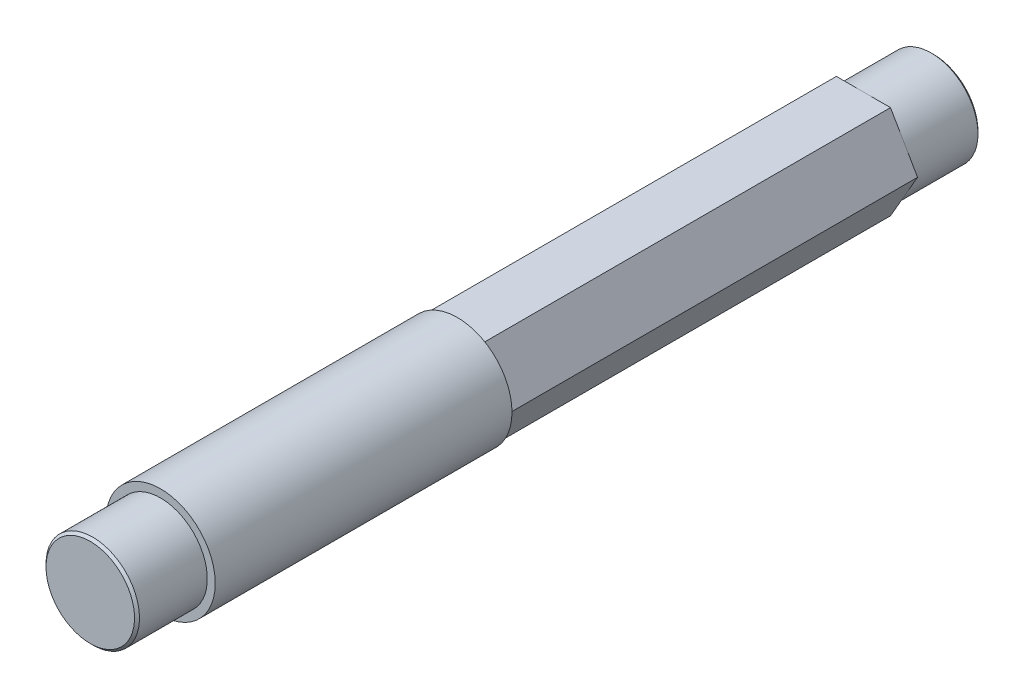
ISO-10303-21;
HEADER;
FILE_DESCRIPTION(('STEP AP214'),'2;1');
FILE_NAME('part.step','',(''),(''),'','','');
FILE_SCHEMA(('AUTOMOTIVE_DESIGN { 1 0 10303 214 1 1 1 1 }'));
ENDSEC;
DATA;
#1=APPLICATION_CONTEXT('core data for automotive mechanical design processes');
#2=APPLICATION_PROTOCOL_DEFINITION('international standard','automotive_design',2000,#1);
#3=PRODUCT_CONTEXT('',#1,'mechanical');
#4=PRODUCT('Part','Part','',(#3));
#5=PRODUCT_RELATED_PRODUCT_CATEGORY('part','',(#4));
#6=PRODUCT_DEFINITION_FORMATION('','',#4);
#7=PRODUCT_DEFINITION_CONTEXT('part definition',#1,'design');
#8=PRODUCT_DEFINITION('design','',#6,#7);
#9=PRODUCT_DEFINITION_SHAPE('','',#8);
#10=(LENGTH_UNIT() NAMED_UNIT(*) SI_UNIT(.MILLI.,.METRE.));
#11=(NAMED_UNIT(*) PLANE_ANGLE_UNIT() SI_UNIT($,.RADIAN.));
#12=(NAMED_UNIT(*) SI_UNIT($,.STERADIAN.) SOLID_ANGLE_UNIT());
#13=UNCERTAINTY_MEASURE_WITH_UNIT(LENGTH_MEASURE(1.E-05),#10,'distance_accuracy_value','');
#14=(GEOMETRIC_REPRESENTATION_CONTEXT(3) GLOBAL_UNCERTAINTY_ASSIGNED_CONTEXT((#13)) GLOBAL_UNIT_ASSIGNED_CONTEXT((#10,
#11,#12)) REPRESENTATION_CONTEXT('',''));
#15=CARTESIAN_POINT('',(0.,0.,0.));
#16=DIRECTION('',(0.,0.,1.));
#17=DIRECTION('',(1.,0.,0.));
#18=AXIS2_PLACEMENT_3D('',#15,#16,#17);
#19=CARTESIAN_POINT('',(0.,0.,-42.8625));
#20=DIRECTION('',(0.,0.,-1.));
#21=DIRECTION('',(-1.,0.,0.));
#22=AXIS2_PLACEMENT_3D('',#19,#20,#21);
#23=PLANE('',#22);
#24=CARTESIAN_POINT('',(0.,0.,-42.8625000000125));
#25=DIRECTION('',(0.,0.,1.));
#26=DIRECTION('',(1.,0.,0.));
#27=AXIS2_PLACEMENT_3D('',#24,#25,#26);
#28=CIRCLE('',#27,4.49980000001915);
#29=CARTESIAN_POINT('',(4.49980000001915,0.,-42.8625000000125));
#30=VERTEX_POINT('',#29);
#31=EDGE_CURVE('E21',#30,#30,#28,.T.);
#32=ORIENTED_EDGE('',*,*,#31,.F.);
#33=EDGE_LOOP('',(#32));
#34=FACE_BOUND('',#33,.T.);
#35=ADVANCED_FACE('F18',(#34),#23,.T.);
#36=CARTESIAN_POINT('',(0.,0.,-42.6125000000752));
#37=DIRECTION('',(0.,0.,1.));
#38=DIRECTION('',(1.,0.,0.));
#39=AXIS2_PLACEMENT_3D('',#36,#37,#38);
#40=CONICAL_SURFACE('',#39,4.74979999995639,0.785398163397448);
#41=CARTESIAN_POINT('',(0.,0.,-42.6125));
#42=DIRECTION('',(0.,0.,1.));
#43=DIRECTION('',(1.,0.,0.));
#44=AXIS2_PLACEMENT_3D('',#41,#42,#43);
#45=CIRCLE('',#44,4.7498);
#46=CARTESIAN_POINT('',(4.7498,0.,-42.6125));
#47=VERTEX_POINT('',#46);
#48=EDGE_CURVE('E103',#47,#47,#45,.T.);
#49=ORIENTED_EDGE('',*,*,#48,.F.);
#50=EDGE_LOOP('',(#49));
#51=FACE_BOUND('',#50,.T.);
#52=ORIENTED_EDGE('',*,*,#31,.T.);
#53=EDGE_LOOP('',(#52));
#54=FACE_BOUND('',#53,.T.);
#55=ADVANCED_FACE('F227',(#51,#54),#40,.T.);
#56=CARTESIAN_POINT('',(0.,0.,-42.8625));
#57=DIRECTION('',(0.,0.,1.));
#58=DIRECTION('',(1.,0.,0.));
#59=AXIS2_PLACEMENT_3D('',#56,#57,#58);
#60=CYLINDRICAL_SURFACE('',#59,4.7498);
#61=CARTESIAN_POINT('',(0.,0.,-35.71875));
#62=DIRECTION('',(0.,0.,1.));
#63=DIRECTION('',(1.,0.,0.));
#64=AXIS2_PLACEMENT_3D('',#61,#62,#63);
#65=CIRCLE('',#64,4.7498);
#66=CARTESIAN_POINT('',(4.7498,0.,-35.71875));
#67=VERTEX_POINT('',#66);
#68=EDGE_CURVE('E105',#67,#67,#65,.F.);
#69=ORIENTED_EDGE('',*,*,#68,.T.);
#70=EDGE_LOOP('',(#69));
#71=FACE_BOUND('',#70,.T.);
#72=ORIENTED_EDGE('',*,*,#48,.T.);
#73=EDGE_LOOP('',(#72));
#74=FACE_BOUND('',#73,.T.);
#75=ADVANCED_FACE('F117',(#71,#74),#60,.T.);
#76=CARTESIAN_POINT('',(0.,0.,42.8625));
#77=DIRECTION('',(0.,0.,1.));
#78=DIRECTION('',(1.,0.,0.));
#79=AXIS2_PLACEMENT_3D('',#76,#77,#78);
#80=PLANE('',#79);
#81=CARTESIAN_POINT('',(0.,0.,42.8625000000125));
#82=DIRECTION('',(0.,0.,-1.));
#83=DIRECTION('',(-1.,0.,0.));
#84=AXIS2_PLACEMENT_3D('',#81,#82,#83);
#85=CIRCLE('',#84,4.49980000001915);
#86=CARTESIAN_POINT('',(-4.49980000001915,0.,42.8625000000125));
#87=VERTEX_POINT('',#86);
#88=EDGE_CURVE('E81',#87,#87,#85,.T.);
#89=ORIENTED_EDGE('',*,*,#88,.F.);
#90=EDGE_LOOP('',(#89));
#91=FACE_BOUND('',#90,.T.);
#92=ADVANCED_FACE('F121',(#91),#80,.T.);
#93=CARTESIAN_POINT('',(0.,0.,-35.71875));
#94=DIRECTION('',(0.,0.,1.));
#95=DIRECTION('',(1.,0.,0.));
#96=AXIS2_PLACEMENT_3D('',#93,#94,#95);
#97=PLANE('',#96);
#98=DIRECTION('',(1.,0.,0.));
#99=VECTOR('',#98,1.);
#100=CARTESIAN_POINT('',(-2.7496306570156,-4.76250000000002,-35.71875));
#101=LINE('',#100,#99);
#102=CARTESIAN_POINT('',(2.74963065701558,-4.76250000000002,-35.71875));
#103=VERTEX_POINT('',#102);
#104=CARTESIAN_POINT('',(-2.7496306570156,-4.76250000000002,-35.71875));
#105=VERTEX_POINT('',#104);
#106=EDGE_CURVE('E77',#103,#105,#101,.F.);
#107=ORIENTED_EDGE('',*,*,#106,.T.);
#108=DIRECTION('',(-0.499999999999999,0.866025403784439,0.));
#109=VECTOR('',#108,1.);
#110=CARTESIAN_POINT('',(-5.49926131403121,0.,-35.71875));
#111=LINE('',#110,#109);
#112=CARTESIAN_POINT('',(-5.49926131403121,0.,-35.71875));
#113=VERTEX_POINT('',#112);
#114=EDGE_CURVE('E72',#105,#113,#111,.T.);
#115=ORIENTED_EDGE('',*,*,#114,.T.);
#116=DIRECTION('',(0.5,0.866025403784439,0.));
#117=VECTOR('',#116,1.);
#118=CARTESIAN_POINT('',(-2.7496306570156,4.76250000000003,-35.71875));
#119=LINE('',#118,#117);
#120=CARTESIAN_POINT('',(-2.7496306570156,4.76250000000003,-35.71875));
#121=VERTEX_POINT('',#120);
#122=EDGE_CURVE('E69',#113,#121,#119,.T.);
#123=ORIENTED_EDGE('',*,*,#122,.T.);
#124=DIRECTION('',(1.,0.,0.));
#125=VECTOR('',#124,1.);
#126=CARTESIAN_POINT('',(2.74963065701557,4.76250000000003,-35.71875));
#127=LINE('',#126,#125);
#128=CARTESIAN_POINT('',(2.74963065701557,4.76250000000003,-35.71875));
#129=VERTEX_POINT('',#128);
#130=EDGE_CURVE('E95',#121,#129,#127,.T.);
#131=ORIENTED_EDGE('',*,*,#130,.T.);
#132=DIRECTION('',(0.5,-0.866025403784439,0.));
#133=VECTOR('',#132,1.);
#134=CARTESIAN_POINT('',(5.49926131403118,0.,-35.71875));
#135=LINE('',#134,#133);
#136=CARTESIAN_POINT('',(5.49926131403118,0.,-35.71875));
#137=VERTEX_POINT('',#136);
#138=EDGE_CURVE('E255',#129,#137,#135,.T.);
#139=ORIENTED_EDGE('',*,*,#138,.T.);
#140=DIRECTION('',(-0.499999999999999,-0.866025403784439,0.));
#141=VECTOR('',#140,1.);
#142=CARTESIAN_POINT('',(2.74963065701558,-4.76250000000002,-35.71875));
#143=LINE('',#142,#141);
#144=EDGE_CURVE('E261',#137,#103,#143,.T.);
#145=ORIENTED_EDGE('',*,*,#144,.T.);
#146=EDGE_LOOP('',(#107,#115,#123,#131,#139,#145));
#147=FACE_BOUND('',#146,.T.);
#148=ORIENTED_EDGE('',*,*,#68,.F.);
#149=EDGE_LOOP('',(#148));
#150=FACE_BOUND('',#149,.T.);
#151=ADVANCED_FACE('F74',(#147,#150),#97,.F.);
#152=CARTESIAN_POINT('',(0.,0.,42.6125000000752));
#153=DIRECTION('',(0.,0.,-1.));
#154=DIRECTION('',(-1.,0.,0.));
#155=AXIS2_PLACEMENT_3D('',#152,#153,#154);
#156=CONICAL_SURFACE('',#155,4.74979999995639,0.785398163397448);
#157=CARTESIAN_POINT('',(0.,0.,42.6125));
#158=DIRECTION('',(0.,0.,-1.));
#159=DIRECTION('',(-1.,0.,0.));
#160=AXIS2_PLACEMENT_3D('',#157,#158,#159);
#161=CIRCLE('',#160,4.7498);
#162=CARTESIAN_POINT('',(-4.7498,0.,42.6125));
#163=VERTEX_POINT('',#162);
#164=EDGE_CURVE('E99',#163,#163,#161,.T.);
#165=ORIENTED_EDGE('',*,*,#164,.F.);
#166=EDGE_LOOP('',(#165));
#167=FACE_BOUND('',#166,.T.);
#168=ORIENTED_EDGE('',*,*,#88,.T.);
#169=EDGE_LOOP('',(#168));
#170=FACE_BOUND('',#169,.T.);
#171=ADVANCED_FACE('F120',(#167,#170),#156,.T.);
#172=CARTESIAN_POINT('',(-5.49926131403121,0.,35.71875));
#173=DIRECTION('',(0.866025403784439,0.499999999999999,0.));
#174=DIRECTION('',(-0.499999999999999,0.866025403784439,0.));
#175=AXIS2_PLACEMENT_3D('',#172,#173,#174);
#176=PLANE('',#175);
#177=DIRECTION('',(0.,0.,1.));
#178=VECTOR('',#177,1.);
#179=CARTESIAN_POINT('',(-5.49926131403121,0.,35.71875));
#180=LINE('',#179,#178);
#181=CARTESIAN_POINT('',(-5.49926131403121,0.,5.55625));
#182=VERTEX_POINT('',#181);
#183=EDGE_CURVE('E80',#182,#113,#180,.F.);
#184=ORIENTED_EDGE('',*,*,#183,.T.);
#185=ORIENTED_EDGE('',*,*,#114,.F.);
#186=DIRECTION('',(0.,0.,1.));
#187=VECTOR('',#186,1.);
#188=CARTESIAN_POINT('',(-2.7496306570156,-4.76250000000002,35.71875));
#189=LINE('',#188,#187);
#190=CARTESIAN_POINT('',(-2.7496306570156,-4.76250000000002,5.55625));
#191=VERTEX_POINT('',#190);
#192=EDGE_CURVE('E102',#105,#191,#189,.T.);
#193=ORIENTED_EDGE('',*,*,#192,.T.);
#194=DIRECTION('',(-0.5,0.866025403784439,0.));
#195=VECTOR('',#194,1.);
#196=CARTESIAN_POINT('',(-2.7496306570156,-4.76250000000002,5.55625));
#197=LINE('',#196,#195);
#198=EDGE_CURVE('E86',#191,#182,#197,.T.);
#199=ORIENTED_EDGE('',*,*,#198,.T.);
#200=EDGE_LOOP('',(#184,#185,#193,#199));
#201=FACE_BOUND('',#200,.T.);
#202=ADVANCED_FACE('F84',(#201),#176,.F.);
#203=CARTESIAN_POINT('',(-2.7496306570156,4.76250000000003,35.71875));
#204=DIRECTION('',(0.866025403784439,-0.5,0.));
#205=DIRECTION('',(0.5,0.866025403784439,0.));
#206=AXIS2_PLACEMENT_3D('',#203,#204,#205);
#207=PLANE('',#206);
#208=DIRECTION('',(0.,0.,-1.));
#209=VECTOR('',#208,1.);
#210=CARTESIAN_POINT('',(-2.7496306570156,4.76250000000003,35.71875));
#211=LINE('',#210,#209);
#212=CARTESIAN_POINT('',(-2.7496306570156,4.76250000000003,5.55625));
#213=VERTEX_POINT('',#212);
#214=EDGE_CURVE('E92',#213,#121,#211,.T.);
#215=ORIENTED_EDGE('',*,*,#214,.T.);
#216=ORIENTED_EDGE('',*,*,#122,.F.);
#217=ORIENTED_EDGE('',*,*,#183,.F.);
#218=DIRECTION('',(0.5,0.866025403784439,0.));
#219=VECTOR('',#218,1.);
#220=CARTESIAN_POINT('',(-5.49926131403121,0.,5.55625));
#221=LINE('',#220,#219);
#222=EDGE_CURVE('E270',#182,#213,#221,.T.);
#223=ORIENTED_EDGE('',*,*,#222,.T.);
#224=EDGE_LOOP('',(#215,#216,#217,#223));
#225=FACE_BOUND('',#224,.T.);
#226=ADVANCED_FACE('F90',(#225),#207,.F.);
#227=CARTESIAN_POINT('',(2.74963065701557,4.76250000000003,35.71875));
#228=DIRECTION('',(0.,-1.,0.));
#229=DIRECTION('',(0.,0.,-1.));
#230=AXIS2_PLACEMENT_3D('',#227,#228,#229);
#231=PLANE('',#230);
#232=DIRECTION('',(0.,0.,1.));
#233=VECTOR('',#232,1.);
#234=CARTESIAN_POINT('',(2.74963065701557,4.76250000000003,35.71875));
#235=LINE('',#234,#233);
#236=CARTESIAN_POINT('',(2.74963065701557,4.76250000000003,5.55625));
#237=VERTEX_POINT('',#236);
#238=EDGE_CURVE('E250',#237,#129,#235,.F.);
#239=ORIENTED_EDGE('',*,*,#238,.T.);
#240=ORIENTED_EDGE('',*,*,#130,.F.);
#241=ORIENTED_EDGE('',*,*,#214,.F.);
#242=DIRECTION('',(1.,0.,0.));
#243=VECTOR('',#242,1.);
#244=CARTESIAN_POINT('',(0.,4.76250000000003,5.55625));
#245=LINE('',#244,#243);
#246=EDGE_CURVE('E253',#213,#237,#245,.T.);
#247=ORIENTED_EDGE('',*,*,#246,.T.);
#248=EDGE_LOOP('',(#239,#240,#241,#247));
#249=FACE_BOUND('',#248,.T.);
#250=ADVANCED_FACE('F162',(#249),#231,.F.);
#251=CARTESIAN_POINT('',(5.49926131403118,0.,35.71875));
#252=DIRECTION('',(-0.866025403784439,-0.5,0.));
#253=DIRECTION('',(0.5,-0.866025403784439,0.));
#254=AXIS2_PLACEMENT_3D('',#251,#252,#253);
#255=PLANE('',#254);
#256=DIRECTION('',(0.,0.,1.));
#257=VECTOR('',#256,1.);
#258=CARTESIAN_POINT('',(5.49926131403118,0.,35.71875));
#259=LINE('',#258,#257);
#260=CARTESIAN_POINT('',(5.49926131403118,0.,5.55624999999999));
#261=VERTEX_POINT('',#260);
#262=EDGE_CURVE('E258',#261,#137,#259,.F.);
#263=ORIENTED_EDGE('',*,*,#262,.T.);
#264=ORIENTED_EDGE('',*,*,#138,.F.);
#265=ORIENTED_EDGE('',*,*,#238,.F.);
#266=DIRECTION('',(0.5,-0.866025403784439,0.));
#267=VECTOR('',#266,1.);
#268=CARTESIAN_POINT('',(2.74963065701557,4.76250000000003,5.55625));
#269=LINE('',#268,#267);
#270=EDGE_CURVE('E273',#237,#261,#269,.T.);
#271=ORIENTED_EDGE('',*,*,#270,.T.);
#272=EDGE_LOOP('',(#263,#264,#265,#271));
#273=FACE_BOUND('',#272,.T.);
#274=ADVANCED_FACE('F159',(#273),#255,.F.);
#275=CARTESIAN_POINT('',(2.74963065701558,-4.76250000000002,35.71875));
#276=DIRECTION('',(-0.866025403784439,0.499999999999999,0.));
#277=DIRECTION('',(-0.499999999999999,-0.866025403784439,0.));
#278=AXIS2_PLACEMENT_3D('',#275,#276,#277);
#279=PLANE('',#278);
#280=DIRECTION('',(0.,0.,1.));
#281=VECTOR('',#280,1.);
#282=CARTESIAN_POINT('',(2.74963065701558,-4.76250000000002,35.71875));
#283=LINE('',#282,#281);
#284=CARTESIAN_POINT('',(2.74963065701558,-4.76250000000002,5.55624999999999));
#285=VERTEX_POINT('',#284);
#286=EDGE_CURVE('E265',#285,#103,#283,.F.);
#287=ORIENTED_EDGE('',*,*,#286,.T.);
#288=ORIENTED_EDGE('',*,*,#144,.F.);
#289=ORIENTED_EDGE('',*,*,#262,.F.);
#290=DIRECTION('',(-0.499999999999999,-0.866025403784439,0.));
#291=VECTOR('',#290,1.);
#292=CARTESIAN_POINT('',(5.49926131403118,0.,5.55625));
#293=LINE('',#292,#291);
#294=EDGE_CURVE('E36',#261,#285,#293,.T.);
#295=ORIENTED_EDGE('',*,*,#294,.T.);
#296=EDGE_LOOP('',(#287,#288,#289,#295));
#297=FACE_BOUND('',#296,.T.);
#298=ADVANCED_FACE('F155',(#297),#279,.F.);
#299=CARTESIAN_POINT('',(-2.7496306570156,-4.76250000000002,35.71875));
#300=DIRECTION('',(0.,1.,0.));
#301=DIRECTION('',(0.,0.,1.));
#302=AXIS2_PLACEMENT_3D('',#299,#300,#301);
#303=PLANE('',#302);
#304=ORIENTED_EDGE('',*,*,#192,.F.);
#305=ORIENTED_EDGE('',*,*,#106,.F.);
#306=ORIENTED_EDGE('',*,*,#286,.F.);
#307=DIRECTION('',(1.,0.,0.));
#308=VECTOR('',#307,1.);
#309=CARTESIAN_POINT('',(0.,-4.76250000000002,5.55625));
#310=LINE('',#309,#308);
#311=EDGE_CURVE('E112',#285,#191,#310,.F.);
#312=ORIENTED_EDGE('',*,*,#311,.T.);
#313=EDGE_LOOP('',(#304,#305,#306,#312));
#314=FACE_BOUND('',#313,.T.);
#315=ADVANCED_FACE('F151',(#314),#303,.F.);
#316=CARTESIAN_POINT('',(0.,0.,42.8625));
#317=DIRECTION('',(0.,0.,-1.));
#318=DIRECTION('',(-1.,0.,0.));
#319=AXIS2_PLACEMENT_3D('',#316,#317,#318);
#320=CYLINDRICAL_SURFACE('',#319,4.7498);
#321=CARTESIAN_POINT('',(0.,0.,35.71875));
#322=DIRECTION('',(0.,0.,-1.));
#323=DIRECTION('',(-1.,0.,0.));
#324=AXIS2_PLACEMENT_3D('',#321,#322,#323);
#325=CIRCLE('',#324,4.7498);
#326=CARTESIAN_POINT('',(-4.7498,0.,35.71875));
#327=VERTEX_POINT('',#326);
#328=EDGE_CURVE('E109',#327,#327,#325,.T.);
#329=ORIENTED_EDGE('',*,*,#328,.F.);
#330=EDGE_LOOP('',(#329));
#331=FACE_BOUND('',#330,.T.);
#332=ORIENTED_EDGE('',*,*,#164,.T.);
#333=EDGE_LOOP('',(#332));
#334=FACE_BOUND('',#333,.T.);
#335=ADVANCED_FACE('F147',(#331,#334),#320,.T.);
#336=CARTESIAN_POINT('',(0.,0.,5.55625));
#337=DIRECTION('',(0.,0.,1.));
#338=DIRECTION('',(1.,0.,0.));
#339=AXIS2_PLACEMENT_3D('',#336,#337,#338);
#340=PLANE('',#339);
#341=ORIENTED_EDGE('',*,*,#294,.F.);
#342=ORIENTED_EDGE('',*,*,#270,.F.);
#343=ORIENTED_EDGE('',*,*,#246,.F.);
#344=ORIENTED_EDGE('',*,*,#222,.F.);
#345=ORIENTED_EDGE('',*,*,#198,.F.);
#346=ORIENTED_EDGE('',*,*,#311,.F.);
#347=EDGE_LOOP('',(#341,#342,#343,#344,#345,#346));
#348=FACE_BOUND('',#347,.T.);
#349=CARTESIAN_POINT('',(0.,0.,5.55625));
#350=DIRECTION('',(0.,0.,1.));
#351=DIRECTION('',(1.,0.,0.));
#352=AXIS2_PLACEMENT_3D('',#349,#350,#351);
#353=CIRCLE('',#352,5.55625);
#354=CARTESIAN_POINT('',(5.55625,0.,5.55625));
#355=VERTEX_POINT('',#354);
#356=EDGE_CURVE('E27',#355,#355,#353,.T.);
#357=ORIENTED_EDGE('',*,*,#356,.F.);
#358=EDGE_LOOP('',(#357));
#359=FACE_BOUND('',#358,.T.);
#360=ADVANCED_FACE('F140',(#348,#359),#340,.F.);
#361=CARTESIAN_POINT('',(0.,0.,35.71875));
#362=DIRECTION('',(0.,0.,1.));
#363=DIRECTION('',(1.,0.,0.));
#364=AXIS2_PLACEMENT_3D('',#361,#362,#363);
#365=PLANE('',#364);
#366=CARTESIAN_POINT('',(0.,0.,35.71875));
#367=DIRECTION('',(0.,0.,1.));
#368=DIRECTION('',(1.,0.,0.));
#369=AXIS2_PLACEMENT_3D('',#366,#367,#368);
#370=CIRCLE('',#369,5.55625);
#371=CARTESIAN_POINT('',(5.55625,0.,35.71875));
#372=VERTEX_POINT('',#371);
#373=EDGE_CURVE('E11',#372,#372,#370,.F.);
#374=ORIENTED_EDGE('',*,*,#373,.F.);
#375=EDGE_LOOP('',(#374));
#376=FACE_BOUND('',#375,.T.);
#377=ORIENTED_EDGE('',*,*,#328,.T.);
#378=EDGE_LOOP('',(#377));
#379=FACE_BOUND('',#378,.T.);
#380=ADVANCED_FACE('F134',(#376,#379),#365,.T.);
#381=CARTESIAN_POINT('',(0.,0.,5.55625));
#382=DIRECTION('',(0.,0.,1.));
#383=DIRECTION('',(1.,0.,0.));
#384=AXIS2_PLACEMENT_3D('',#381,#382,#383);
#385=CYLINDRICAL_SURFACE('',#384,5.55625);
#386=ORIENTED_EDGE('',*,*,#373,.T.);
#387=EDGE_LOOP('',(#386));
#388=FACE_BOUND('',#387,.T.);
#389=ORIENTED_EDGE('',*,*,#356,.T.);
#390=EDGE_LOOP('',(#389));
#391=FACE_BOUND('',#390,.T.);
#392=ADVANCED_FACE('F132',(#388,#391),#385,.T.);
#393=CLOSED_SHELL('',(#35,#55,#75,#92,#151,#171,#202,#226,#250,#274,#298,#315,#335,#360,#380,#392));
#394=MANIFOLD_SOLID_BREP('B1',#393);
#395=ADVANCED_BREP_SHAPE_REPRESENTATION('',(#18,#394),#14);
#396=SHAPE_DEFINITION_REPRESENTATION(#9,#395);
ENDSEC;
END-ISO-10303-21;
